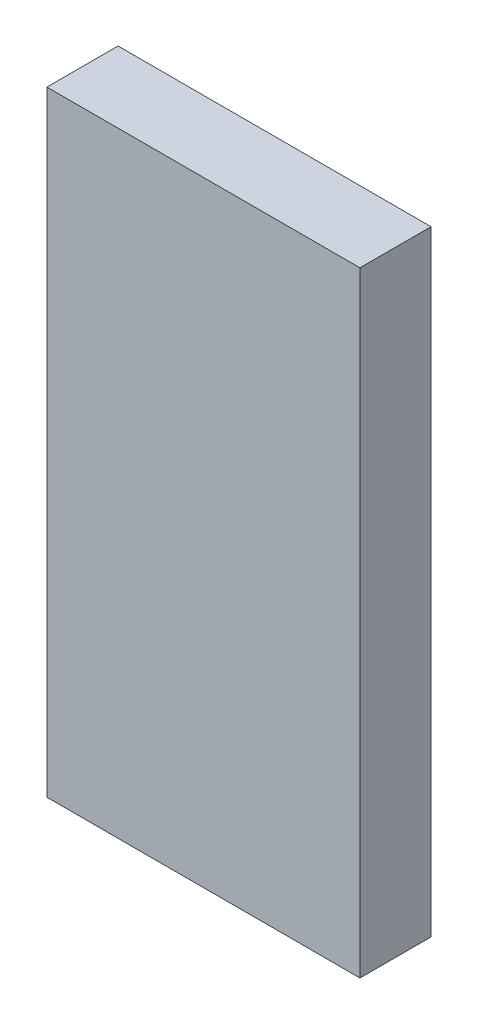
ISO-10303-21;
HEADER;
FILE_DESCRIPTION(('STEP AP214'),'2;1');
FILE_NAME('part.step','',(''),(''),'','','');
FILE_SCHEMA(('AUTOMOTIVE_DESIGN { 1 0 10303 214 1 1 1 1 }'));
ENDSEC;
DATA;
#1=APPLICATION_CONTEXT('core data for automotive mechanical design processes');
#2=APPLICATION_PROTOCOL_DEFINITION('international standard','automotive_design',2000,#1);
#3=PRODUCT_CONTEXT('',#1,'mechanical');
#4=PRODUCT('Part','Part','',(#3));
#5=PRODUCT_RELATED_PRODUCT_CATEGORY('part','',(#4));
#6=PRODUCT_DEFINITION_FORMATION('','',#4);
#7=PRODUCT_DEFINITION_CONTEXT('part definition',#1,'design');
#8=PRODUCT_DEFINITION('design','',#6,#7);
#9=PRODUCT_DEFINITION_SHAPE('','',#8);
#10=(LENGTH_UNIT() NAMED_UNIT(*) SI_UNIT(.MILLI.,.METRE.));
#11=(NAMED_UNIT(*) PLANE_ANGLE_UNIT() SI_UNIT($,.RADIAN.));
#12=(NAMED_UNIT(*) SI_UNIT($,.STERADIAN.) SOLID_ANGLE_UNIT());
#13=UNCERTAINTY_MEASURE_WITH_UNIT(LENGTH_MEASURE(1.E-05),#10,'distance_accuracy_value','');
#14=(GEOMETRIC_REPRESENTATION_CONTEXT(3) GLOBAL_UNCERTAINTY_ASSIGNED_CONTEXT((#13)) GLOBAL_UNIT_ASSIGNED_CONTEXT((#10,
#11,#12)) REPRESENTATION_CONTEXT('',''));
#15=CARTESIAN_POINT('',(0.,0.,0.));
#16=DIRECTION('',(0.,0.,1.));
#17=DIRECTION('',(1.,0.,0.));
#18=AXIS2_PLACEMENT_3D('',#15,#16,#17);
#19=CARTESIAN_POINT('',(-0.22,1.5805,0.));
#20=DIRECTION('',(1.,0.,0.));
#21=DIRECTION('',(0.,0.,1.));
#22=AXIS2_PLACEMENT_3D('',#19,#20,#21);
#23=PLANE('',#22);
#24=DIRECTION('',(0.,1.,0.));
#25=VECTOR('',#24,1.);
#26=CARTESIAN_POINT('',(-0.22,1.5805,0.1));
#27=LINE('',#26,#25);
#28=CARTESIAN_POINT('',(-0.22,1.5805,0.1));
#29=VERTEX_POINT('',#28);
#30=CARTESIAN_POINT('',(-0.22,2.445,0.1));
#31=VERTEX_POINT('',#30);
#32=EDGE_CURVE('E10',#29,#31,#27,.T.);
#33=ORIENTED_EDGE('',*,*,#32,.T.);
#34=DIRECTION('',(0.,0.,1.));
#35=VECTOR('',#34,1.);
#36=CARTESIAN_POINT('',(-0.22,2.445,0.));
#37=LINE('',#36,#35);
#38=CARTESIAN_POINT('',(-0.22,2.445,0.));
#39=VERTEX_POINT('',#38);
#40=EDGE_CURVE('E23',#39,#31,#37,.T.);
#41=ORIENTED_EDGE('',*,*,#40,.F.);
#42=DIRECTION('',(0.,1.,0.));
#43=VECTOR('',#42,1.);
#44=CARTESIAN_POINT('',(-0.22,1.5805,0.));
#45=LINE('',#44,#43);
#46=CARTESIAN_POINT('',(-0.22,1.5805,0.));
#47=VERTEX_POINT('',#46);
#48=EDGE_CURVE('E85',#47,#39,#45,.T.);
#49=ORIENTED_EDGE('',*,*,#48,.F.);
#50=DIRECTION('',(0.,0.,1.));
#51=VECTOR('',#50,1.);
#52=CARTESIAN_POINT('',(-0.22,1.5805,0.));
#53=LINE('',#52,#51);
#54=EDGE_CURVE('E35',#47,#29,#53,.T.);
#55=ORIENTED_EDGE('',*,*,#54,.T.);
#56=EDGE_LOOP('',(#33,#41,#49,#55));
#57=FACE_BOUND('',#56,.T.);
#58=ADVANCED_FACE('F16',(#57),#23,.F.);
#59=CARTESIAN_POINT('',(0.22,1.5805,0.));
#60=DIRECTION('',(1.,0.,0.));
#61=DIRECTION('',(0.,0.,1.));
#62=AXIS2_PLACEMENT_3D('',#59,#60,#61);
#63=PLANE('',#62);
#64=DIRECTION('',(0.,0.,1.));
#65=VECTOR('',#64,1.);
#66=CARTESIAN_POINT('',(0.22,1.5805,0.));
#67=LINE('',#66,#65);
#68=CARTESIAN_POINT('',(0.22,1.5805,0.));
#69=VERTEX_POINT('',#68);
#70=CARTESIAN_POINT('',(0.22,1.5805,0.1));
#71=VERTEX_POINT('',#70);
#72=EDGE_CURVE('E82',#69,#71,#67,.T.);
#73=ORIENTED_EDGE('',*,*,#72,.F.);
#74=DIRECTION('',(0.,1.,0.));
#75=VECTOR('',#74,1.);
#76=CARTESIAN_POINT('',(0.22,1.5805,0.));
#77=LINE('',#76,#75);
#78=CARTESIAN_POINT('',(0.22,2.445,0.));
#79=VERTEX_POINT('',#78);
#80=EDGE_CURVE('E62',#69,#79,#77,.T.);
#81=ORIENTED_EDGE('',*,*,#80,.T.);
#82=DIRECTION('',(0.,0.,1.));
#83=VECTOR('',#82,1.);
#84=CARTESIAN_POINT('',(0.22,2.445,0.));
#85=LINE('',#84,#83);
#86=CARTESIAN_POINT('',(0.22,2.445,0.1));
#87=VERTEX_POINT('',#86);
#88=EDGE_CURVE('E56',#79,#87,#85,.T.);
#89=ORIENTED_EDGE('',*,*,#88,.T.);
#90=DIRECTION('',(0.,1.,0.));
#91=VECTOR('',#90,1.);
#92=CARTESIAN_POINT('',(0.22,1.5805,0.1));
#93=LINE('',#92,#91);
#94=EDGE_CURVE('E59',#71,#87,#93,.T.);
#95=ORIENTED_EDGE('',*,*,#94,.F.);
#96=EDGE_LOOP('',(#73,#81,#89,#95));
#97=FACE_BOUND('',#96,.T.);
#98=ADVANCED_FACE('F58',(#97),#63,.T.);
#99=CARTESIAN_POINT('',(-0.22,1.5805,0.));
#100=DIRECTION('',(0.,1.,0.));
#101=DIRECTION('',(0.,0.,1.));
#102=AXIS2_PLACEMENT_3D('',#99,#100,#101);
#103=PLANE('',#102);
#104=ORIENTED_EDGE('',*,*,#72,.T.);
#105=DIRECTION('',(1.,0.,0.));
#106=VECTOR('',#105,1.);
#107=CARTESIAN_POINT('',(-0.22,1.5805,0.1));
#108=LINE('',#107,#106);
#109=EDGE_CURVE('E70',#29,#71,#108,.T.);
#110=ORIENTED_EDGE('',*,*,#109,.F.);
#111=ORIENTED_EDGE('',*,*,#54,.F.);
#112=DIRECTION('',(1.,0.,0.));
#113=VECTOR('',#112,1.);
#114=CARTESIAN_POINT('',(-0.22,1.5805,0.));
#115=LINE('',#114,#113);
#116=EDGE_CURVE('E75',#47,#69,#115,.T.);
#117=ORIENTED_EDGE('',*,*,#116,.T.);
#118=EDGE_LOOP('',(#104,#110,#111,#117));
#119=FACE_BOUND('',#118,.T.);
#120=ADVANCED_FACE('F90',(#119),#103,.F.);
#121=CARTESIAN_POINT('',(-0.22,2.445,0.));
#122=DIRECTION('',(0.,1.,0.));
#123=DIRECTION('',(0.,0.,1.));
#124=AXIS2_PLACEMENT_3D('',#121,#122,#123);
#125=PLANE('',#124);
#126=DIRECTION('',(1.,0.,0.));
#127=VECTOR('',#126,1.);
#128=CARTESIAN_POINT('',(-0.22,2.445,0.));
#129=LINE('',#128,#127);
#130=EDGE_CURVE('E73',#39,#79,#129,.T.);
#131=ORIENTED_EDGE('',*,*,#130,.F.);
#132=ORIENTED_EDGE('',*,*,#40,.T.);
#133=DIRECTION('',(1.,0.,0.));
#134=VECTOR('',#133,1.);
#135=CARTESIAN_POINT('',(-0.22,2.445,0.1));
#136=LINE('',#135,#134);
#137=EDGE_CURVE('E68',#31,#87,#136,.T.);
#138=ORIENTED_EDGE('',*,*,#137,.T.);
#139=ORIENTED_EDGE('',*,*,#88,.F.);
#140=EDGE_LOOP('',(#131,#132,#138,#139));
#141=FACE_BOUND('',#140,.T.);
#142=ADVANCED_FACE('F72',(#141),#125,.T.);
#143=CARTESIAN_POINT('',(-0.22,1.5805,0.));
#144=DIRECTION('',(0.,0.,1.));
#145=DIRECTION('',(1.,0.,0.));
#146=AXIS2_PLACEMENT_3D('',#143,#144,#145);
#147=PLANE('',#146);
#148=ORIENTED_EDGE('',*,*,#130,.T.);
#149=ORIENTED_EDGE('',*,*,#80,.F.);
#150=ORIENTED_EDGE('',*,*,#116,.F.);
#151=ORIENTED_EDGE('',*,*,#48,.T.);
#152=EDGE_LOOP('',(#148,#149,#150,#151));
#153=FACE_BOUND('',#152,.T.);
#154=ADVANCED_FACE('F88',(#153),#147,.F.);
#155=CARTESIAN_POINT('',(-0.22,1.5805,0.1));
#156=DIRECTION('',(0.,0.,1.));
#157=DIRECTION('',(1.,0.,0.));
#158=AXIS2_PLACEMENT_3D('',#155,#156,#157);
#159=PLANE('',#158);
#160=ORIENTED_EDGE('',*,*,#32,.F.);
#161=ORIENTED_EDGE('',*,*,#109,.T.);
#162=ORIENTED_EDGE('',*,*,#94,.T.);
#163=ORIENTED_EDGE('',*,*,#137,.F.);
#164=EDGE_LOOP('',(#160,#161,#162,#163));
#165=FACE_BOUND('',#164,.T.);
#166=ADVANCED_FACE('F67',(#165),#159,.T.);
#167=CLOSED_SHELL('',(#58,#98,#120,#142,#154,#166));
#168=MANIFOLD_SOLID_BREP('B1',#167);
#169=ADVANCED_BREP_SHAPE_REPRESENTATION('',(#18,#168),#14);
#170=SHAPE_DEFINITION_REPRESENTATION(#9,#169);
ENDSEC;
END-ISO-10303-21;
